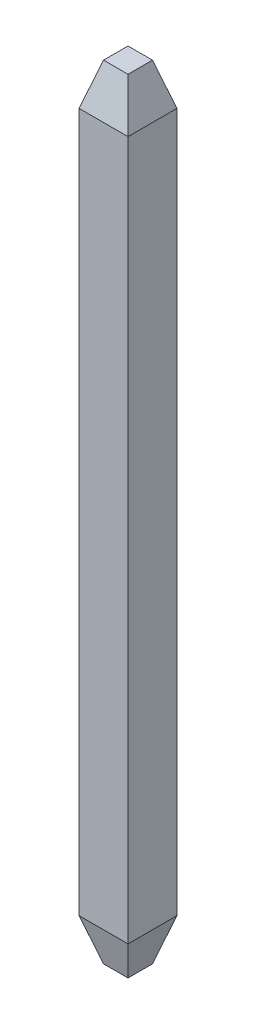
ISO-10303-21;
HEADER;
FILE_DESCRIPTION(('STEP AP214'),'2;1');
FILE_NAME('part.step','',(''),(''),'','','');
FILE_SCHEMA(('AUTOMOTIVE_DESIGN { 1 0 10303 214 1 1 1 1 }'));
ENDSEC;
DATA;
#1=APPLICATION_CONTEXT('core data for automotive mechanical design processes');
#2=APPLICATION_PROTOCOL_DEFINITION('international standard','automotive_design',2000,#1);
#3=PRODUCT_CONTEXT('',#1,'mechanical');
#4=PRODUCT('Part','Part','',(#3));
#5=PRODUCT_RELATED_PRODUCT_CATEGORY('part','',(#4));
#6=PRODUCT_DEFINITION_FORMATION('','',#4);
#7=PRODUCT_DEFINITION_CONTEXT('part definition',#1,'design');
#8=PRODUCT_DEFINITION('design','',#6,#7);
#9=PRODUCT_DEFINITION_SHAPE('','',#8);
#10=(LENGTH_UNIT() NAMED_UNIT(*) SI_UNIT(.MILLI.,.METRE.));
#11=(NAMED_UNIT(*) PLANE_ANGLE_UNIT() SI_UNIT($,.RADIAN.));
#12=(NAMED_UNIT(*) SI_UNIT($,.STERADIAN.) SOLID_ANGLE_UNIT());
#13=UNCERTAINTY_MEASURE_WITH_UNIT(LENGTH_MEASURE(1.E-05),#10,'distance_accuracy_value','');
#14=(GEOMETRIC_REPRESENTATION_CONTEXT(3) GLOBAL_UNCERTAINTY_ASSIGNED_CONTEXT((#13)) GLOBAL_UNIT_ASSIGNED_CONTEXT((#10,
#11,#12)) REPRESENTATION_CONTEXT('',''));
#15=CARTESIAN_POINT('',(0.,0.,0.));
#16=DIRECTION('',(0.,0.,1.));
#17=DIRECTION('',(1.,0.,0.));
#18=AXIS2_PLACEMENT_3D('',#15,#16,#17);
#19=CARTESIAN_POINT('',(-34.449999999987,-10.1039999999833,-19.5199999999763));
#20=DIRECTION('',(-0.959644900900971,-0.281214622974635,0.));
#21=DIRECTION('',(-0.281214622974635,0.959644900900971,0.));
#22=AXIS2_PLACEMENT_3D('',#19,#20,#21);
#23=PLANE('',#22);
#24=DIRECTION('',(0.,0.,-1.));
#25=VECTOR('',#24,1.);
#26=CARTESIAN_POINT('',(-34.449999999987,-10.1039999999833,-19.1999999999763));
#27=LINE('',#26,#25);
#28=CARTESIAN_POINT('',(-34.449999999987,-10.1039999999833,-19.1999999999763));
#29=VERTEX_POINT('',#28);
#30=CARTESIAN_POINT('',(-34.449999999987,-10.1039999999833,-19.8399999999763));
#31=VERTEX_POINT('',#30);
#32=EDGE_CURVE('E11',#29,#31,#27,.T.);
#33=ORIENTED_EDGE('',*,*,#32,.T.);
#34=DIRECTION('',(0.270714017147719,-0.92381158351662,0.270714017147727));
#35=VECTOR('',#34,1.);
#36=CARTESIAN_POINT('',(-34.449999999987,-10.1039999999833,-19.8399999999763));
#37=LINE('',#36,#35);
#38=CARTESIAN_POINT('',(-34.289999999987,-10.6499999999833,-19.6799999999763));
#39=VERTEX_POINT('',#38);
#40=EDGE_CURVE('E28',#31,#39,#37,.T.);
#41=ORIENTED_EDGE('',*,*,#40,.T.);
#42=DIRECTION('',(0.,0.,-1.));
#43=VECTOR('',#42,1.);
#44=CARTESIAN_POINT('',(-34.289999999987,-10.6499999999833,-19.3599999999763));
#45=LINE('',#44,#43);
#46=CARTESIAN_POINT('',(-34.289999999987,-10.6499999999833,-19.3599999999763));
#47=VERTEX_POINT('',#46);
#48=EDGE_CURVE('E118',#47,#39,#45,.T.);
#49=ORIENTED_EDGE('',*,*,#48,.F.);
#50=DIRECTION('',(0.270714017147719,-0.92381158351662,-0.270714017147727));
#51=VECTOR('',#50,1.);
#52=CARTESIAN_POINT('',(-34.449999999987,-10.1039999999833,-19.1999999999763));
#53=LINE('',#52,#51);
#54=EDGE_CURVE('E100',#29,#47,#53,.T.);
#55=ORIENTED_EDGE('',*,*,#54,.F.);
#56=EDGE_LOOP('',(#33,#41,#49,#55));
#57=FACE_BOUND('',#56,.T.);
#58=ADVANCED_FACE('F17',(#57),#23,.T.);
#59=CARTESIAN_POINT('',(-34.449999999987,-5.53543505344803,-19.1989999999763));
#60=DIRECTION('',(-1.,0.,0.));
#61=DIRECTION('',(0.,0.,1.));
#62=AXIS2_PLACEMENT_3D('',#59,#60,#61);
#63=PLANE('',#62);
#64=DIRECTION('',(0.,1.,0.));
#65=VECTOR('',#64,1.);
#66=CARTESIAN_POINT('',(-34.449999999987,-10.1039999999833,-19.8399999999763));
#67=LINE('',#66,#65);
#68=CARTESIAN_POINT('',(-34.449999999987,-0.965870106912755,-19.8399999999763));
#69=VERTEX_POINT('',#68);
#70=EDGE_CURVE('E42',#31,#69,#67,.T.);
#71=ORIENTED_EDGE('',*,*,#70,.F.);
#72=ORIENTED_EDGE('',*,*,#32,.F.);
#73=DIRECTION('',(0.,1.,0.));
#74=VECTOR('',#73,1.);
#75=CARTESIAN_POINT('',(-34.449999999987,-10.1039999999833,-19.1999999999763));
#76=LINE('',#75,#74);
#77=CARTESIAN_POINT('',(-34.449999999987,-0.965870106912755,-19.1999999999763));
#78=VERTEX_POINT('',#77);
#79=EDGE_CURVE('E148',#29,#78,#76,.T.);
#80=ORIENTED_EDGE('',*,*,#79,.T.);
#81=DIRECTION('',(0.,0.,-1.));
#82=VECTOR('',#81,1.);
#83=CARTESIAN_POINT('',(-34.449999999987,-0.965870106912753,-19.1999999999763));
#84=LINE('',#83,#82);
#85=EDGE_CURVE('E154',#78,#69,#84,.T.);
#86=ORIENTED_EDGE('',*,*,#85,.T.);
#87=EDGE_LOOP('',(#71,#72,#80,#86));
#88=FACE_BOUND('',#87,.T.);
#89=ADVANCED_FACE('F242',(#88),#63,.T.);
#90=CARTESIAN_POINT('',(-33.8089999999869,-5.53443505344803,-19.8399999999763));
#91=DIRECTION('',(0.,0.,-1.));
#92=DIRECTION('',(0.,-1.,0.));
#93=AXIS2_PLACEMENT_3D('',#90,#91,#92);
#94=PLANE('',#93);
#95=DIRECTION('',(0.,1.,0.));
#96=VECTOR('',#95,1.);
#97=CARTESIAN_POINT('',(-33.8099999999869,-10.1039999999833,-19.8399999999763));
#98=LINE('',#97,#96);
#99=CARTESIAN_POINT('',(-33.809999999987,-10.1039999999833,-19.8399999999763));
#100=VERTEX_POINT('',#99);
#101=CARTESIAN_POINT('',(-33.809999999987,-0.965870106912755,-19.8399999999763));
#102=VERTEX_POINT('',#101);
#103=EDGE_CURVE('E133',#100,#102,#98,.T.);
#104=ORIENTED_EDGE('',*,*,#103,.F.);
#105=DIRECTION('',(1.,0.,0.));
#106=VECTOR('',#105,1.);
#107=CARTESIAN_POINT('',(-34.449999999987,-10.1039999999833,-19.8399999999763));
#108=LINE('',#107,#106);
#109=EDGE_CURVE('E21',#31,#100,#108,.T.);
#110=ORIENTED_EDGE('',*,*,#109,.F.);
#111=ORIENTED_EDGE('',*,*,#70,.T.);
#112=DIRECTION('',(1.,0.,0.));
#113=VECTOR('',#112,1.);
#114=CARTESIAN_POINT('',(-34.449999999987,-0.965870106912753,-19.8399999999763));
#115=LINE('',#114,#113);
#116=EDGE_CURVE('E129',#69,#102,#115,.T.);
#117=ORIENTED_EDGE('',*,*,#116,.T.);
#118=EDGE_LOOP('',(#104,#110,#111,#117));
#119=FACE_BOUND('',#118,.T.);
#120=ADVANCED_FACE('F244',(#119),#94,.T.);
#121=CARTESIAN_POINT('',(-33.8099999999869,-11.0738701069128,-19.5199999999763));
#122=DIRECTION('',(1.,0.,0.));
#123=DIRECTION('',(0.,1.,0.));
#124=AXIS2_PLACEMENT_3D('',#121,#122,#123);
#125=PLANE('',#124);
#126=DIRECTION('',(0.,1.,0.));
#127=VECTOR('',#126,1.);
#128=CARTESIAN_POINT('',(-33.8099999999869,-10.1039999999833,-19.1999999999763));
#129=LINE('',#128,#127);
#130=CARTESIAN_POINT('',(-33.809999999987,-10.1039999999833,-19.1999999999763));
#131=VERTEX_POINT('',#130);
#132=CARTESIAN_POINT('',(-33.809999999987,-0.965870106912755,-19.1999999999763));
#133=VERTEX_POINT('',#132);
#134=EDGE_CURVE('E127',#131,#133,#129,.T.);
#135=ORIENTED_EDGE('',*,*,#134,.F.);
#136=DIRECTION('',(0.,0.,1.));
#137=VECTOR('',#136,1.);
#138=CARTESIAN_POINT('',(-33.8099999999869,-10.1039999999833,-19.8399999999763));
#139=LINE('',#138,#137);
#140=EDGE_CURVE('E107',#100,#131,#139,.T.);
#141=ORIENTED_EDGE('',*,*,#140,.F.);
#142=ORIENTED_EDGE('',*,*,#103,.T.);
#143=DIRECTION('',(0.,0.,1.));
#144=VECTOR('',#143,1.);
#145=CARTESIAN_POINT('',(-33.8099999999869,-0.965870106912753,-19.8399999999763));
#146=LINE('',#145,#144);
#147=EDGE_CURVE('E143',#102,#133,#146,.T.);
#148=ORIENTED_EDGE('',*,*,#147,.T.);
#149=EDGE_LOOP('',(#135,#141,#142,#148));
#150=FACE_BOUND('',#149,.T.);
#151=ADVANCED_FACE('F252',(#150),#125,.T.);
#152=CARTESIAN_POINT('',(-33.8099999999869,-0.965870106912753,-19.5199999999763));
#153=DIRECTION('',(0.95964490090097,0.281214622974636,0.));
#154=DIRECTION('',(0.,0.,-1.));
#155=AXIS2_PLACEMENT_3D('',#152,#153,#154);
#156=PLANE('',#155);
#157=DIRECTION('',(-0.27071401714772,0.923811583516619,0.270714017147728));
#158=VECTOR('',#157,1.);
#159=CARTESIAN_POINT('',(-33.8099999999869,-0.965870106912753,-19.8399999999763));
#160=LINE('',#159,#158);
#161=CARTESIAN_POINT('',(-33.969999999987,-0.419870106912756,-19.6799999999763));
#162=VERTEX_POINT('',#161);
#163=EDGE_CURVE('E138',#102,#162,#160,.T.);
#164=ORIENTED_EDGE('',*,*,#163,.T.);
#165=DIRECTION('',(0.,0.,1.));
#166=VECTOR('',#165,1.);
#167=CARTESIAN_POINT('',(-33.9699999999869,-0.419870106912754,-19.6799999999763));
#168=LINE('',#167,#166);
#169=CARTESIAN_POINT('',(-33.969999999987,-0.419870106912756,-19.3599999999763));
#170=VERTEX_POINT('',#169);
#171=EDGE_CURVE('E134',#162,#170,#168,.T.);
#172=ORIENTED_EDGE('',*,*,#171,.T.);
#173=DIRECTION('',(-0.27071401714772,0.923811583516619,-0.270714017147728));
#174=VECTOR('',#173,1.);
#175=CARTESIAN_POINT('',(-33.8099999999869,-0.965870106912753,-19.1999999999763));
#176=LINE('',#175,#174);
#177=EDGE_CURVE('E139',#133,#170,#176,.T.);
#178=ORIENTED_EDGE('',*,*,#177,.F.);
#179=ORIENTED_EDGE('',*,*,#147,.F.);
#180=EDGE_LOOP('',(#164,#172,#178,#179));
#181=FACE_BOUND('',#180,.T.);
#182=ADVANCED_FACE('F205',(#181),#156,.T.);
#183=CARTESIAN_POINT('',(-34.1299999999869,-0.965870106912753,-19.1999999999763));
#184=DIRECTION('',(0.,0.281214622974644,0.959644900900968));
#185=DIRECTION('',(1.,0.,0.));
#186=AXIS2_PLACEMENT_3D('',#183,#184,#185);
#187=PLANE('',#186);
#188=ORIENTED_EDGE('',*,*,#177,.T.);
#189=DIRECTION('',(-1.,0.,0.));
#190=VECTOR('',#189,1.);
#191=CARTESIAN_POINT('',(-33.9699999999869,-0.419870106912754,-19.3599999999763));
#192=LINE('',#191,#190);
#193=CARTESIAN_POINT('',(-34.289999999987,-0.419870106912756,-19.3599999999763));
#194=VERTEX_POINT('',#193);
#195=EDGE_CURVE('E145',#170,#194,#192,.T.);
#196=ORIENTED_EDGE('',*,*,#195,.T.);
#197=DIRECTION('',(0.27071401714772,0.923811583516619,-0.270714017147728));
#198=VECTOR('',#197,1.);
#199=CARTESIAN_POINT('',(-34.449999999987,-0.965870106912753,-19.1999999999763));
#200=LINE('',#199,#198);
#201=EDGE_CURVE('E171',#78,#194,#200,.T.);
#202=ORIENTED_EDGE('',*,*,#201,.F.);
#203=DIRECTION('',(-1.,0.,0.));
#204=VECTOR('',#203,1.);
#205=CARTESIAN_POINT('',(-33.8099999999869,-0.965870106912753,-19.1999999999763));
#206=LINE('',#205,#204);
#207=EDGE_CURVE('E218',#133,#78,#206,.T.);
#208=ORIENTED_EDGE('',*,*,#207,.F.);
#209=EDGE_LOOP('',(#188,#196,#202,#208));
#210=FACE_BOUND('',#209,.T.);
#211=ADVANCED_FACE('F228',(#210),#187,.T.);
#212=CARTESIAN_POINT('',(-34.129999999987,-0.419870106912754,-19.6809999999763));
#213=DIRECTION('',(0.,1.,0.));
#214=DIRECTION('',(1.,0.,0.));
#215=AXIS2_PLACEMENT_3D('',#212,#213,#214);
#216=PLANE('',#215);
#217=DIRECTION('',(1.,0.,0.));
#218=VECTOR('',#217,1.);
#219=CARTESIAN_POINT('',(-34.289999999987,-0.419870106912754,-19.6799999999763));
#220=LINE('',#219,#218);
#221=CARTESIAN_POINT('',(-34.289999999987,-0.419870106912756,-19.6799999999763));
#222=VERTEX_POINT('',#221);
#223=EDGE_CURVE('E167',#222,#162,#220,.T.);
#224=ORIENTED_EDGE('',*,*,#223,.F.);
#225=DIRECTION('',(0.,0.,-1.));
#226=VECTOR('',#225,1.);
#227=CARTESIAN_POINT('',(-34.289999999987,-0.419870106912754,-19.3599999999763));
#228=LINE('',#227,#226);
#229=EDGE_CURVE('E176',#194,#222,#228,.T.);
#230=ORIENTED_EDGE('',*,*,#229,.F.);
#231=ORIENTED_EDGE('',*,*,#195,.F.);
#232=ORIENTED_EDGE('',*,*,#171,.F.);
#233=EDGE_LOOP('',(#224,#230,#231,#232));
#234=FACE_BOUND('',#233,.T.);
#235=ADVANCED_FACE('F198',(#234),#216,.T.);
#236=CARTESIAN_POINT('',(-33.8099999999869,-10.1039999999833,-19.5199999999763));
#237=DIRECTION('',(0.959644900900971,-0.281214622974635,0.));
#238=DIRECTION('',(0.,0.,-1.));
#239=AXIS2_PLACEMENT_3D('',#236,#237,#238);
#240=PLANE('',#239);
#241=ORIENTED_EDGE('',*,*,#140,.T.);
#242=DIRECTION('',(-0.270714017147719,-0.92381158351662,-0.270714017147727));
#243=VECTOR('',#242,1.);
#244=CARTESIAN_POINT('',(-33.8099999999869,-10.1039999999833,-19.1999999999763));
#245=LINE('',#244,#243);
#246=CARTESIAN_POINT('',(-33.969999999987,-10.6499999999833,-19.3599999999763));
#247=VERTEX_POINT('',#246);
#248=EDGE_CURVE('E104',#131,#247,#245,.T.);
#249=ORIENTED_EDGE('',*,*,#248,.T.);
#250=DIRECTION('',(0.,0.,1.));
#251=VECTOR('',#250,1.);
#252=CARTESIAN_POINT('',(-33.9699999999869,-10.6499999999833,-19.6799999999763));
#253=LINE('',#252,#251);
#254=CARTESIAN_POINT('',(-33.969999999987,-10.6499999999833,-19.6799999999763));
#255=VERTEX_POINT('',#254);
#256=EDGE_CURVE('E92',#255,#247,#253,.T.);
#257=ORIENTED_EDGE('',*,*,#256,.F.);
#258=DIRECTION('',(-0.270714017147719,-0.92381158351662,0.270714017147727));
#259=VECTOR('',#258,1.);
#260=CARTESIAN_POINT('',(-33.8099999999869,-10.1039999999833,-19.8399999999763));
#261=LINE('',#260,#259);
#262=EDGE_CURVE('E84',#100,#255,#261,.T.);
#263=ORIENTED_EDGE('',*,*,#262,.F.);
#264=EDGE_LOOP('',(#241,#249,#257,#263));
#265=FACE_BOUND('',#264,.T.);
#266=ADVANCED_FACE('F105',(#265),#240,.T.);
#267=CARTESIAN_POINT('',(-34.1299999999869,-0.965870106912753,-19.8399999999763));
#268=DIRECTION('',(0.,0.281214622974644,-0.959644900900968));
#269=DIRECTION('',(-1.,0.,0.));
#270=AXIS2_PLACEMENT_3D('',#267,#268,#269);
#271=PLANE('',#270);
#272=DIRECTION('',(0.27071401714772,0.923811583516619,0.270714017147728));
#273=VECTOR('',#272,1.);
#274=CARTESIAN_POINT('',(-34.449999999987,-0.965870106912753,-19.8399999999763));
#275=LINE('',#274,#273);
#276=EDGE_CURVE('E112',#69,#222,#275,.T.);
#277=ORIENTED_EDGE('',*,*,#276,.T.);
#278=ORIENTED_EDGE('',*,*,#223,.T.);
#279=ORIENTED_EDGE('',*,*,#163,.F.);
#280=ORIENTED_EDGE('',*,*,#116,.F.);
#281=EDGE_LOOP('',(#277,#278,#279,#280));
#282=FACE_BOUND('',#281,.T.);
#283=ADVANCED_FACE('F183',(#282),#271,.T.);
#284=CARTESIAN_POINT('',(-34.449999999987,-0.965870106912753,-19.5199999999763));
#285=DIRECTION('',(-0.95964490090097,0.281214622974636,0.));
#286=DIRECTION('',(0.,0.,1.));
#287=AXIS2_PLACEMENT_3D('',#284,#285,#286);
#288=PLANE('',#287);
#289=ORIENTED_EDGE('',*,*,#201,.T.);
#290=ORIENTED_EDGE('',*,*,#229,.T.);
#291=ORIENTED_EDGE('',*,*,#276,.F.);
#292=ORIENTED_EDGE('',*,*,#85,.F.);
#293=EDGE_LOOP('',(#289,#290,#291,#292));
#294=FACE_BOUND('',#293,.T.);
#295=ADVANCED_FACE('F189',(#294),#288,.T.);
#296=CARTESIAN_POINT('',(-34.4509999999869,-5.53543505344803,-19.1999999999763));
#297=DIRECTION('',(0.,0.,1.));
#298=DIRECTION('',(1.,0.,0.));
#299=AXIS2_PLACEMENT_3D('',#296,#297,#298);
#300=PLANE('',#299);
#301=ORIENTED_EDGE('',*,*,#79,.F.);
#302=DIRECTION('',(-1.,0.,0.));
#303=VECTOR('',#302,1.);
#304=CARTESIAN_POINT('',(-33.8099999999869,-10.1039999999833,-19.1999999999763));
#305=LINE('',#304,#303);
#306=EDGE_CURVE('E215',#131,#29,#305,.T.);
#307=ORIENTED_EDGE('',*,*,#306,.F.);
#308=ORIENTED_EDGE('',*,*,#134,.T.);
#309=ORIENTED_EDGE('',*,*,#207,.T.);
#310=EDGE_LOOP('',(#301,#307,#308,#309));
#311=FACE_BOUND('',#310,.T.);
#312=ADVANCED_FACE('F240',(#311),#300,.T.);
#313=CARTESIAN_POINT('',(-34.1299999999869,-10.1039999999833,-19.1999999999763));
#314=DIRECTION('',(0.,-0.281214622974642,0.959644900900969));
#315=DIRECTION('',(-1.,0.,0.));
#316=AXIS2_PLACEMENT_3D('',#313,#314,#315);
#317=PLANE('',#316);
#318=ORIENTED_EDGE('',*,*,#306,.T.);
#319=ORIENTED_EDGE('',*,*,#54,.T.);
#320=DIRECTION('',(-1.,0.,0.));
#321=VECTOR('',#320,1.);
#322=CARTESIAN_POINT('',(-33.9699999999869,-10.6499999999833,-19.3599999999763));
#323=LINE('',#322,#321);
#324=EDGE_CURVE('E96',#247,#47,#323,.T.);
#325=ORIENTED_EDGE('',*,*,#324,.F.);
#326=ORIENTED_EDGE('',*,*,#248,.F.);
#327=EDGE_LOOP('',(#318,#319,#325,#326));
#328=FACE_BOUND('',#327,.T.);
#329=ADVANCED_FACE('F115',(#328),#317,.T.);
#330=CARTESIAN_POINT('',(-34.2909999999869,-10.6499999999833,-19.5199999999763));
#331=DIRECTION('',(0.,-1.,0.));
#332=DIRECTION('',(0.,0.,-1.));
#333=AXIS2_PLACEMENT_3D('',#330,#331,#332);
#334=PLANE('',#333);
#335=ORIENTED_EDGE('',*,*,#256,.T.);
#336=ORIENTED_EDGE('',*,*,#324,.T.);
#337=ORIENTED_EDGE('',*,*,#48,.T.);
#338=DIRECTION('',(1.,0.,0.));
#339=VECTOR('',#338,1.);
#340=CARTESIAN_POINT('',(-34.289999999987,-10.6499999999833,-19.6799999999763));
#341=LINE('',#340,#339);
#342=EDGE_CURVE('E97',#39,#255,#341,.T.);
#343=ORIENTED_EDGE('',*,*,#342,.T.);
#344=EDGE_LOOP('',(#335,#336,#337,#343));
#345=FACE_BOUND('',#344,.T.);
#346=ADVANCED_FACE('F94',(#345),#334,.T.);
#347=CARTESIAN_POINT('',(-34.1299999999869,-10.1039999999833,-19.8399999999763));
#348=DIRECTION('',(0.,-0.281214622974642,-0.959644900900969));
#349=DIRECTION('',(0.,-0.959644900900969,0.281214622974642));
#350=AXIS2_PLACEMENT_3D('',#347,#348,#349);
#351=PLANE('',#350);
#352=ORIENTED_EDGE('',*,*,#109,.T.);
#353=ORIENTED_EDGE('',*,*,#262,.T.);
#354=ORIENTED_EDGE('',*,*,#342,.F.);
#355=ORIENTED_EDGE('',*,*,#40,.F.);
#356=EDGE_LOOP('',(#352,#353,#354,#355));
#357=FACE_BOUND('',#356,.T.);
#358=ADVANCED_FACE('F19',(#357),#351,.T.);
#359=CLOSED_SHELL('',(#58,#89,#120,#151,#182,#211,#235,#266,#283,#295,#312,#329,#346,#358));
#360=MANIFOLD_SOLID_BREP('B1',#359);
#361=ADVANCED_BREP_SHAPE_REPRESENTATION('',(#18,#360),#14);
#362=SHAPE_DEFINITION_REPRESENTATION(#9,#361);
ENDSEC;
END-ISO-10303-21;
